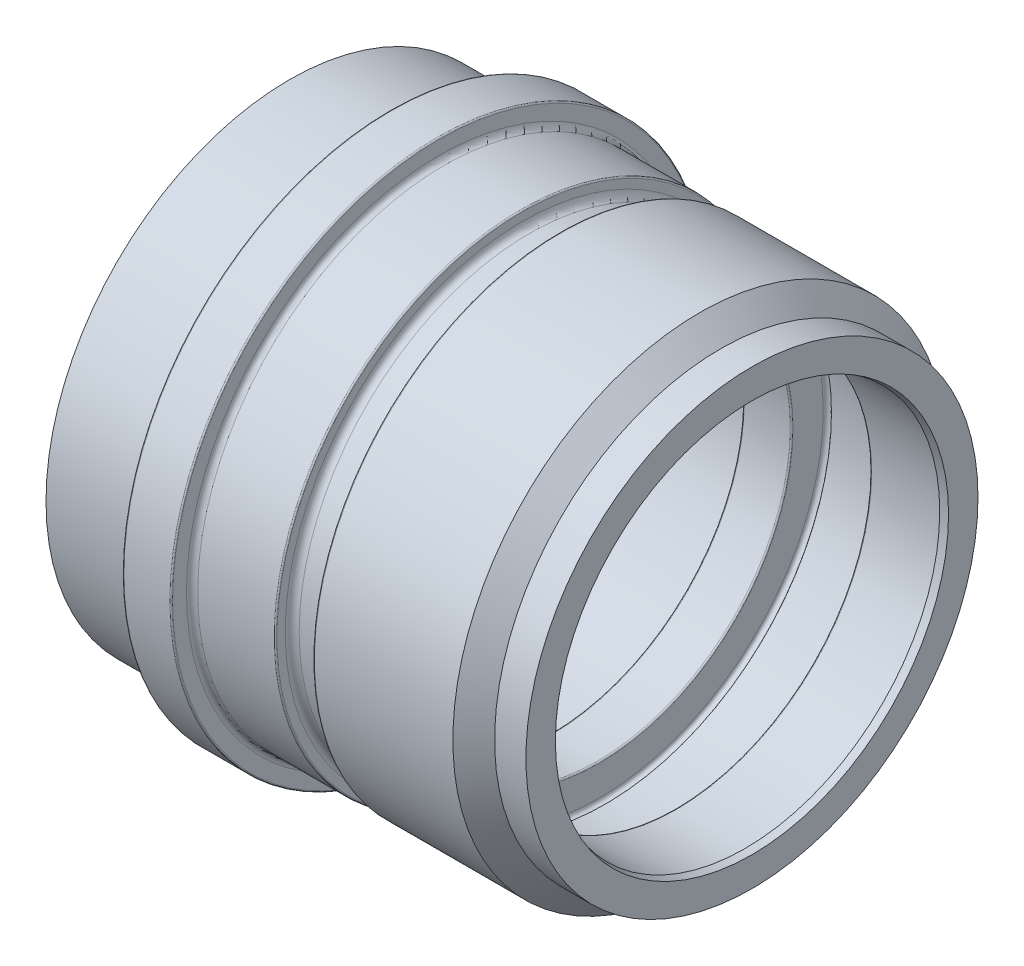
ISO-10303-21;
HEADER;
FILE_DESCRIPTION(('STEP AP214'),'2;1');
FILE_NAME('part.step','',(''),(''),'','','');
FILE_SCHEMA(('AUTOMOTIVE_DESIGN { 1 0 10303 214 1 1 1 1 }'));
ENDSEC;
DATA;
#1=APPLICATION_CONTEXT('core data for automotive mechanical design processes');
#2=APPLICATION_PROTOCOL_DEFINITION('international standard','automotive_design',2000,#1);
#3=PRODUCT_CONTEXT('',#1,'mechanical');
#4=PRODUCT('Part','Part','',(#3));
#5=PRODUCT_RELATED_PRODUCT_CATEGORY('part','',(#4));
#6=PRODUCT_DEFINITION_FORMATION('','',#4);
#7=PRODUCT_DEFINITION_CONTEXT('part definition',#1,'design');
#8=PRODUCT_DEFINITION('design','',#6,#7);
#9=PRODUCT_DEFINITION_SHAPE('','',#8);
#10=(LENGTH_UNIT() NAMED_UNIT(*) SI_UNIT(.MILLI.,.METRE.));
#11=(NAMED_UNIT(*) PLANE_ANGLE_UNIT() SI_UNIT($,.RADIAN.));
#12=(NAMED_UNIT(*) SI_UNIT($,.STERADIAN.) SOLID_ANGLE_UNIT());
#13=UNCERTAINTY_MEASURE_WITH_UNIT(LENGTH_MEASURE(1.E-05),#10,'distance_accuracy_value','');
#14=(GEOMETRIC_REPRESENTATION_CONTEXT(3) GLOBAL_UNCERTAINTY_ASSIGNED_CONTEXT((#13)) GLOBAL_UNIT_ASSIGNED_CONTEXT((#10,
#11,#12)) REPRESENTATION_CONTEXT('',''));
#15=CARTESIAN_POINT('',(0.,0.,0.));
#16=DIRECTION('',(0.,0.,1.));
#17=DIRECTION('',(1.,0.,0.));
#18=AXIS2_PLACEMENT_3D('',#15,#16,#17);
#19=CARTESIAN_POINT('',(-21.5,35.,0.));
#20=DIRECTION('',(-1.,0.,0.));
#21=DIRECTION('',(0.,0.,1.));
#22=AXIS2_PLACEMENT_3D('',#19,#20,#21);
#23=PLANE('',#22);
#24=CARTESIAN_POINT('',(-21.5,0.,0.));
#25=DIRECTION('',(1.,0.,0.));
#26=DIRECTION('',(0.,0.,-1.));
#27=AXIS2_PLACEMENT_3D('',#24,#25,#26);
#28=CIRCLE('',#27,33.0773502691896);
#29=CARTESIAN_POINT('',(-21.5,0.,-33.0773502691896));
#30=VERTEX_POINT('',#29);
#31=EDGE_CURVE('E170',#30,#30,#28,.T.);
#32=ORIENTED_EDGE('',*,*,#31,.T.);
#33=EDGE_LOOP('',(#32));
#34=FACE_BOUND('',#33,.T.);
#35=CARTESIAN_POINT('',(-21.5,0.,0.));
#36=DIRECTION('',(1.,0.,0.));
#37=DIRECTION('',(0.,0.,-1.));
#38=AXIS2_PLACEMENT_3D('',#35,#36,#37);
#39=CIRCLE('',#38,35.);
#40=CARTESIAN_POINT('',(-21.5,0.,-35.));
#41=VERTEX_POINT('',#40);
#42=EDGE_CURVE('E10',#41,#41,#39,.T.);
#43=ORIENTED_EDGE('',*,*,#42,.F.);
#44=EDGE_LOOP('',(#43));
#45=FACE_BOUND('',#44,.T.);
#46=ADVANCED_FACE('F37',(#34,#45),#23,.T.);
#47=CARTESIAN_POINT('',(0.,0.,0.));
#48=DIRECTION('',(1.,0.,0.));
#49=DIRECTION('',(0.,0.,-1.));
#50=AXIS2_PLACEMENT_3D('',#47,#48,#49);
#51=CYLINDRICAL_SURFACE('',#50,35.);
#52=ORIENTED_EDGE('',*,*,#42,.T.);
#53=EDGE_LOOP('',(#52));
#54=FACE_BOUND('',#53,.T.);
#55=CARTESIAN_POINT('',(-7.2,0.,0.));
#56=DIRECTION('',(1.,0.,0.));
#57=DIRECTION('',(0.,0.,-1.));
#58=AXIS2_PLACEMENT_3D('',#55,#56,#57);
#59=CIRCLE('',#58,35.);
#60=CARTESIAN_POINT('',(-7.2,0.,-35.));
#61=VERTEX_POINT('',#60);
#62=EDGE_CURVE('E43',#61,#61,#59,.T.);
#63=ORIENTED_EDGE('',*,*,#62,.F.);
#64=EDGE_LOOP('',(#63));
#65=FACE_BOUND('',#64,.T.);
#66=ADVANCED_FACE('F188',(#54,#65),#51,.T.);
#67=CARTESIAN_POINT('',(-7.2,0.,0.));
#68=DIRECTION('',(1.,0.,0.));
#69=DIRECTION('',(0.,0.,-1.));
#70=AXIS2_PLACEMENT_3D('',#67,#68,#69);
#71=TOROIDAL_SURFACE('',#70,35.2,0.2);
#72=ORIENTED_EDGE('',*,*,#62,.T.);
#73=EDGE_LOOP('',(#72));
#74=FACE_BOUND('',#73,.T.);
#75=CARTESIAN_POINT('',(-7.,0.,0.));
#76=DIRECTION('',(1.,0.,0.));
#77=DIRECTION('',(0.,0.,-1.));
#78=AXIS2_PLACEMENT_3D('',#75,#76,#77);
#79=CIRCLE('',#78,35.2);
#80=CARTESIAN_POINT('',(-7.,0.,-35.2));
#81=VERTEX_POINT('',#80);
#82=EDGE_CURVE('E47',#81,#81,#79,.T.);
#83=ORIENTED_EDGE('',*,*,#82,.F.);
#84=EDGE_LOOP('',(#83));
#85=FACE_BOUND('',#84,.T.);
#86=ADVANCED_FACE('F192',(#74,#85),#71,.F.);
#87=CARTESIAN_POINT('',(-7.,38.3,0.));
#88=DIRECTION('',(-1.,0.,0.));
#89=DIRECTION('',(0.,0.,1.));
#90=AXIS2_PLACEMENT_3D('',#87,#88,#89);
#91=PLANE('',#90);
#92=ORIENTED_EDGE('',*,*,#82,.T.);
#93=EDGE_LOOP('',(#92));
#94=FACE_BOUND('',#93,.T.);
#95=CARTESIAN_POINT('',(-7.,0.,0.));
#96=DIRECTION('',(1.,0.,0.));
#97=DIRECTION('',(0.,0.,-1.));
#98=AXIS2_PLACEMENT_3D('',#95,#96,#97);
#99=CIRCLE('',#98,38.3);
#100=CARTESIAN_POINT('',(-7.,0.,-38.3));
#101=VERTEX_POINT('',#100);
#102=EDGE_CURVE('E51',#101,#101,#99,.T.);
#103=ORIENTED_EDGE('',*,*,#102,.F.);
#104=EDGE_LOOP('',(#103));
#105=FACE_BOUND('',#104,.T.);
#106=ADVANCED_FACE('F196',(#94,#105),#91,.T.);
#107=CARTESIAN_POINT('',(-6.8,0.,0.));
#108=DIRECTION('',(1.,0.,0.));
#109=DIRECTION('',(0.,0.,-1.));
#110=AXIS2_PLACEMENT_3D('',#107,#108,#109);
#111=TOROIDAL_SURFACE('',#110,38.3,0.199999999999999);
#112=ORIENTED_EDGE('',*,*,#102,.T.);
#113=EDGE_LOOP('',(#112));
#114=FACE_BOUND('',#113,.T.);
#115=CARTESIAN_POINT('',(-6.8,0.,0.));
#116=DIRECTION('',(1.,0.,0.));
#117=DIRECTION('',(0.,0.,-1.));
#118=AXIS2_PLACEMENT_3D('',#115,#116,#117);
#119=CIRCLE('',#118,38.5);
#120=CARTESIAN_POINT('',(-6.8,0.,-38.5));
#121=VERTEX_POINT('',#120);
#122=EDGE_CURVE('E56',#121,#121,#119,.T.);
#123=ORIENTED_EDGE('',*,*,#122,.F.);
#124=EDGE_LOOP('',(#123));
#125=FACE_BOUND('',#124,.T.);
#126=ADVANCED_FACE('F202',(#114,#125),#111,.T.);
#127=CARTESIAN_POINT('',(0.,0.,0.));
#128=DIRECTION('',(1.,0.,0.));
#129=DIRECTION('',(0.,0.,-1.));
#130=AXIS2_PLACEMENT_3D('',#127,#128,#129);
#131=CYLINDRICAL_SURFACE('',#130,38.5);
#132=ORIENTED_EDGE('',*,*,#122,.T.);
#133=EDGE_LOOP('',(#132));
#134=FACE_BOUND('',#133,.T.);
#135=CARTESIAN_POINT('',(-0.200000000000001,0.,0.));
#136=DIRECTION('',(1.,0.,0.));
#137=DIRECTION('',(0.,0.,-1.));
#138=AXIS2_PLACEMENT_3D('',#135,#136,#137);
#139=CIRCLE('',#138,38.5);
#140=CARTESIAN_POINT('',(-0.200000000000001,0.,-38.5));
#141=VERTEX_POINT('',#140);
#142=EDGE_CURVE('E59',#141,#141,#139,.T.);
#143=ORIENTED_EDGE('',*,*,#142,.F.);
#144=EDGE_LOOP('',(#143));
#145=FACE_BOUND('',#144,.T.);
#146=ADVANCED_FACE('F206',(#134,#145),#131,.T.);
#147=CARTESIAN_POINT('',(-0.2,0.,0.));
#148=DIRECTION('',(1.,0.,0.));
#149=DIRECTION('',(0.,0.,-1.));
#150=AXIS2_PLACEMENT_3D('',#147,#148,#149);
#151=TOROIDAL_SURFACE('',#150,38.3,0.199999999999999);
#152=ORIENTED_EDGE('',*,*,#142,.T.);
#153=EDGE_LOOP('',(#152));
#154=FACE_BOUND('',#153,.T.);
#155=CARTESIAN_POINT('',(0.,0.,0.));
#156=DIRECTION('',(1.,0.,0.));
#157=DIRECTION('',(0.,0.,-1.));
#158=AXIS2_PLACEMENT_3D('',#155,#156,#157);
#159=CIRCLE('',#158,38.3);
#160=CARTESIAN_POINT('',(0.,0.,-38.3));
#161=VERTEX_POINT('',#160);
#162=EDGE_CURVE('E62',#161,#161,#159,.T.);
#163=ORIENTED_EDGE('',*,*,#162,.F.);
#164=EDGE_LOOP('',(#163));
#165=FACE_BOUND('',#164,.T.);
#166=ADVANCED_FACE('F210',(#154,#165),#151,.T.);
#167=CARTESIAN_POINT('',(0.,36.3,0.));
#168=DIRECTION('',(1.,0.,0.));
#169=DIRECTION('',(0.,0.,-1.));
#170=AXIS2_PLACEMENT_3D('',#167,#168,#169);
#171=PLANE('',#170);
#172=ORIENTED_EDGE('',*,*,#162,.T.);
#173=EDGE_LOOP('',(#172));
#174=FACE_BOUND('',#173,.T.);
#175=CARTESIAN_POINT('',(0.,0.,0.));
#176=DIRECTION('',(1.,0.,0.));
#177=DIRECTION('',(0.,0.,-1.));
#178=AXIS2_PLACEMENT_3D('',#175,#176,#177);
#179=CIRCLE('',#178,36.3);
#180=CARTESIAN_POINT('',(0.,0.,-36.3));
#181=VERTEX_POINT('',#180);
#182=EDGE_CURVE('E65',#181,#181,#179,.T.);
#183=ORIENTED_EDGE('',*,*,#182,.F.);
#184=EDGE_LOOP('',(#183));
#185=FACE_BOUND('',#184,.T.);
#186=ADVANCED_FACE('F214',(#174,#185),#171,.T.);
#187=CARTESIAN_POINT('',(0.8,0.,0.));
#188=DIRECTION('',(1.,0.,0.));
#189=DIRECTION('',(0.,0.,-1.));
#190=AXIS2_PLACEMENT_3D('',#187,#188,#189);
#191=TOROIDAL_SURFACE('',#190,36.3,0.799999999999998);
#192=CARTESIAN_POINT('',(0.8,0.,0.));
#193=DIRECTION('',(1.,0.,0.));
#194=DIRECTION('',(0.,0.,-1.));
#195=AXIS2_PLACEMENT_3D('',#192,#193,#194);
#196=CIRCLE('',#195,35.5);
#197=CARTESIAN_POINT('',(0.8,0.,-35.5));
#198=VERTEX_POINT('',#197);
#199=EDGE_CURVE('E68',#198,#198,#196,.T.);
#200=ORIENTED_EDGE('',*,*,#199,.F.);
#201=EDGE_LOOP('',(#200));
#202=FACE_BOUND('',#201,.T.);
#203=ORIENTED_EDGE('',*,*,#182,.T.);
#204=EDGE_LOOP('',(#203));
#205=FACE_BOUND('',#204,.T.);
#206=ADVANCED_FACE('F218',(#202,#205),#191,.F.);
#207=CARTESIAN_POINT('',(0.,0.,0.));
#208=DIRECTION('',(1.,0.,0.));
#209=DIRECTION('',(0.,0.,-1.));
#210=AXIS2_PLACEMENT_3D('',#207,#208,#209);
#211=CYLINDRICAL_SURFACE('',#210,35.5);
#212=ORIENTED_EDGE('',*,*,#199,.T.);
#213=EDGE_LOOP('',(#212));
#214=FACE_BOUND('',#213,.T.);
#215=CARTESIAN_POINT('',(11.8,0.,0.));
#216=DIRECTION('',(1.,0.,0.));
#217=DIRECTION('',(0.,0.,-1.));
#218=AXIS2_PLACEMENT_3D('',#215,#216,#217);
#219=CIRCLE('',#218,35.5);
#220=CARTESIAN_POINT('',(11.8,0.,-35.5));
#221=VERTEX_POINT('',#220);
#222=EDGE_CURVE('E71',#221,#221,#219,.T.);
#223=ORIENTED_EDGE('',*,*,#222,.F.);
#224=EDGE_LOOP('',(#223));
#225=FACE_BOUND('',#224,.T.);
#226=ADVANCED_FACE('F222',(#214,#225),#211,.T.);
#227=CARTESIAN_POINT('',(11.8,0.,0.));
#228=DIRECTION('',(1.,0.,0.));
#229=DIRECTION('',(0.,0.,-1.));
#230=AXIS2_PLACEMENT_3D('',#227,#228,#229);
#231=TOROIDAL_SURFACE('',#230,35.3,0.2);
#232=ORIENTED_EDGE('',*,*,#222,.T.);
#233=EDGE_LOOP('',(#232));
#234=FACE_BOUND('',#233,.T.);
#235=CARTESIAN_POINT('',(12.,0.,0.));
#236=DIRECTION('',(1.,0.,0.));
#237=DIRECTION('',(0.,0.,-1.));
#238=AXIS2_PLACEMENT_3D('',#235,#236,#237);
#239=CIRCLE('',#238,35.3);
#240=CARTESIAN_POINT('',(12.,0.,-35.3));
#241=VERTEX_POINT('',#240);
#242=EDGE_CURVE('E74',#241,#241,#239,.T.);
#243=ORIENTED_EDGE('',*,*,#242,.F.);
#244=EDGE_LOOP('',(#243));
#245=FACE_BOUND('',#244,.T.);
#246=ADVANCED_FACE('F226',(#234,#245),#231,.T.);
#247=CARTESIAN_POINT('',(12.,34.1,0.));
#248=DIRECTION('',(1.,0.,0.));
#249=DIRECTION('',(0.,0.,-1.));
#250=AXIS2_PLACEMENT_3D('',#247,#248,#249);
#251=PLANE('',#250);
#252=ORIENTED_EDGE('',*,*,#242,.T.);
#253=EDGE_LOOP('',(#252));
#254=FACE_BOUND('',#253,.T.);
#255=CARTESIAN_POINT('',(12.,0.,0.));
#256=DIRECTION('',(1.,0.,0.));
#257=DIRECTION('',(0.,0.,-1.));
#258=AXIS2_PLACEMENT_3D('',#255,#256,#257);
#259=CIRCLE('',#258,34.1);
#260=CARTESIAN_POINT('',(12.,0.,-34.1));
#261=VERTEX_POINT('',#260);
#262=EDGE_CURVE('E77',#261,#261,#259,.T.);
#263=ORIENTED_EDGE('',*,*,#262,.F.);
#264=EDGE_LOOP('',(#263));
#265=FACE_BOUND('',#264,.T.);
#266=ADVANCED_FACE('F230',(#254,#265),#251,.T.);
#267=CARTESIAN_POINT('',(13.,0.,0.));
#268=DIRECTION('',(1.,0.,0.));
#269=DIRECTION('',(0.,0.,-1.));
#270=AXIS2_PLACEMENT_3D('',#267,#268,#269);
#271=TOROIDAL_SURFACE('',#270,34.1,1.);
#272=ORIENTED_EDGE('',*,*,#262,.T.);
#273=EDGE_LOOP('',(#272));
#274=FACE_BOUND('',#273,.T.);
#275=CARTESIAN_POINT('',(13.,0.,0.));
#276=DIRECTION('',(1.,0.,0.));
#277=DIRECTION('',(0.,0.,-1.));
#278=AXIS2_PLACEMENT_3D('',#275,#276,#277);
#279=CIRCLE('',#278,33.1);
#280=CARTESIAN_POINT('',(13.,0.,-33.1));
#281=VERTEX_POINT('',#280);
#282=EDGE_CURVE('E80',#281,#281,#279,.T.);
#283=ORIENTED_EDGE('',*,*,#282,.F.);
#284=EDGE_LOOP('',(#283));
#285=FACE_BOUND('',#284,.T.);
#286=ADVANCED_FACE('F234',(#274,#285),#271,.F.);
#287=CARTESIAN_POINT('',(0.,0.,0.));
#288=DIRECTION('',(1.,0.,0.));
#289=DIRECTION('',(0.,0.,-1.));
#290=AXIS2_PLACEMENT_3D('',#287,#288,#289);
#291=CYLINDRICAL_SURFACE('',#290,33.1);
#292=ORIENTED_EDGE('',*,*,#282,.T.);
#293=EDGE_LOOP('',(#292));
#294=FACE_BOUND('',#293,.T.);
#295=CARTESIAN_POINT('',(16.4,0.,0.));
#296=DIRECTION('',(1.,0.,0.));
#297=DIRECTION('',(0.,0.,-1.));
#298=AXIS2_PLACEMENT_3D('',#295,#296,#297);
#299=CIRCLE('',#298,33.1);
#300=CARTESIAN_POINT('',(16.4,0.,-33.1));
#301=VERTEX_POINT('',#300);
#302=EDGE_CURVE('E83',#301,#301,#299,.T.);
#303=ORIENTED_EDGE('',*,*,#302,.F.);
#304=EDGE_LOOP('',(#303));
#305=FACE_BOUND('',#304,.T.);
#306=ADVANCED_FACE('F238',(#294,#305),#291,.T.);
#307=CARTESIAN_POINT('',(16.4,0.,0.));
#308=DIRECTION('',(1.,0.,0.));
#309=DIRECTION('',(0.,0.,-1.));
#310=AXIS2_PLACEMENT_3D('',#307,#308,#309);
#311=TOROIDAL_SURFACE('',#310,34.1,1.);
#312=ORIENTED_EDGE('',*,*,#302,.T.);
#313=EDGE_LOOP('',(#312));
#314=FACE_BOUND('',#313,.T.);
#315=CARTESIAN_POINT('',(17.4,0.,0.));
#316=DIRECTION('',(1.,0.,0.));
#317=DIRECTION('',(0.,0.,-1.));
#318=AXIS2_PLACEMENT_3D('',#315,#316,#317);
#319=CIRCLE('',#318,34.1);
#320=CARTESIAN_POINT('',(17.4,0.,-34.1));
#321=VERTEX_POINT('',#320);
#322=EDGE_CURVE('E86',#321,#321,#319,.T.);
#323=ORIENTED_EDGE('',*,*,#322,.F.);
#324=EDGE_LOOP('',(#323));
#325=FACE_BOUND('',#324,.T.);
#326=ADVANCED_FACE('F242',(#314,#325),#311,.F.);
#327=CARTESIAN_POINT('',(17.4,35.3,0.));
#328=DIRECTION('',(-1.,0.,0.));
#329=DIRECTION('',(0.,0.,1.));
#330=AXIS2_PLACEMENT_3D('',#327,#328,#329);
#331=PLANE('',#330);
#332=ORIENTED_EDGE('',*,*,#322,.T.);
#333=EDGE_LOOP('',(#332));
#334=FACE_BOUND('',#333,.T.);
#335=CARTESIAN_POINT('',(17.4,0.,0.));
#336=DIRECTION('',(1.,0.,0.));
#337=DIRECTION('',(0.,0.,-1.));
#338=AXIS2_PLACEMENT_3D('',#335,#336,#337);
#339=CIRCLE('',#338,35.3);
#340=CARTESIAN_POINT('',(17.4,0.,-35.3));
#341=VERTEX_POINT('',#340);
#342=EDGE_CURVE('E89',#341,#341,#339,.T.);
#343=ORIENTED_EDGE('',*,*,#342,.F.);
#344=EDGE_LOOP('',(#343));
#345=FACE_BOUND('',#344,.T.);
#346=ADVANCED_FACE('F246',(#334,#345),#331,.T.);
#347=CARTESIAN_POINT('',(17.6,0.,0.));
#348=DIRECTION('',(1.,0.,0.));
#349=DIRECTION('',(0.,0.,-1.));
#350=AXIS2_PLACEMENT_3D('',#347,#348,#349);
#351=TOROIDAL_SURFACE('',#350,35.3,0.199999999999999);
#352=ORIENTED_EDGE('',*,*,#342,.T.);
#353=EDGE_LOOP('',(#352));
#354=FACE_BOUND('',#353,.T.);
#355=CARTESIAN_POINT('',(17.6,0.,0.));
#356=DIRECTION('',(1.,0.,0.));
#357=DIRECTION('',(0.,0.,-1.));
#358=AXIS2_PLACEMENT_3D('',#355,#356,#357);
#359=CIRCLE('',#358,35.5);
#360=CARTESIAN_POINT('',(17.6,0.,-35.5));
#361=VERTEX_POINT('',#360);
#362=EDGE_CURVE('E92',#361,#361,#359,.T.);
#363=ORIENTED_EDGE('',*,*,#362,.F.);
#364=EDGE_LOOP('',(#363));
#365=FACE_BOUND('',#364,.T.);
#366=ADVANCED_FACE('F250',(#354,#365),#351,.T.);
#367=CARTESIAN_POINT('',(0.,0.,0.));
#368=DIRECTION('',(1.,0.,0.));
#369=DIRECTION('',(0.,0.,-1.));
#370=AXIS2_PLACEMENT_3D('',#367,#368,#369);
#371=CYLINDRICAL_SURFACE('',#370,35.5);
#372=ORIENTED_EDGE('',*,*,#362,.T.);
#373=EDGE_LOOP('',(#372));
#374=FACE_BOUND('',#373,.T.);
#375=CARTESIAN_POINT('',(37.5,0.,0.));
#376=DIRECTION('',(1.,0.,0.));
#377=DIRECTION('',(0.,0.,-1.));
#378=AXIS2_PLACEMENT_3D('',#375,#376,#377);
#379=CIRCLE('',#378,35.5);
#380=CARTESIAN_POINT('',(37.5,0.,-35.5));
#381=VERTEX_POINT('',#380);
#382=EDGE_CURVE('E95',#381,#381,#379,.T.);
#383=ORIENTED_EDGE('',*,*,#382,.F.);
#384=EDGE_LOOP('',(#383));
#385=FACE_BOUND('',#384,.T.);
#386=ADVANCED_FACE('F254',(#374,#385),#371,.T.);
#387=CARTESIAN_POINT('',(40.5,0.,0.));
#388=DIRECTION('',(-1.,0.,0.));
#389=DIRECTION('',(0.,0.,1.));
#390=AXIS2_PLACEMENT_3D('',#387,#388,#389);
#391=CONICAL_SURFACE('',#390,32.5,0.78539816339745);
#392=ORIENTED_EDGE('',*,*,#382,.T.);
#393=EDGE_LOOP('',(#392));
#394=FACE_BOUND('',#393,.T.);
#395=CARTESIAN_POINT('',(40.5,0.,0.));
#396=DIRECTION('',(1.,0.,0.));
#397=DIRECTION('',(0.,0.,-1.));
#398=AXIS2_PLACEMENT_3D('',#395,#396,#397);
#399=CIRCLE('',#398,32.5);
#400=CARTESIAN_POINT('',(40.5,0.,-32.5));
#401=VERTEX_POINT('',#400);
#402=EDGE_CURVE('E98',#401,#401,#399,.T.);
#403=ORIENTED_EDGE('',*,*,#402,.F.);
#404=EDGE_LOOP('',(#403));
#405=FACE_BOUND('',#404,.T.);
#406=ADVANCED_FACE('F258',(#394,#405),#391,.T.);
#407=CARTESIAN_POINT('',(0.,0.,0.));
#408=DIRECTION('',(1.,0.,0.));
#409=DIRECTION('',(0.,0.,-1.));
#410=AXIS2_PLACEMENT_3D('',#407,#408,#409);
#411=CYLINDRICAL_SURFACE('',#410,32.5);
#412=ORIENTED_EDGE('',*,*,#402,.T.);
#413=EDGE_LOOP('',(#412));
#414=FACE_BOUND('',#413,.T.);
#415=CARTESIAN_POINT('',(45.,0.,0.));
#416=DIRECTION('',(1.,0.,0.));
#417=DIRECTION('',(0.,0.,-1.));
#418=AXIS2_PLACEMENT_3D('',#415,#416,#417);
#419=CIRCLE('',#418,32.5);
#420=CARTESIAN_POINT('',(45.,0.,-32.5));
#421=VERTEX_POINT('',#420);
#422=EDGE_CURVE('E101',#421,#421,#419,.T.);
#423=ORIENTED_EDGE('',*,*,#422,.F.);
#424=EDGE_LOOP('',(#423));
#425=FACE_BOUND('',#424,.T.);
#426=ADVANCED_FACE('F262',(#414,#425),#411,.T.);
#427=CARTESIAN_POINT('',(45.,28.2679491924311,0.));
#428=DIRECTION('',(1.,0.,0.));
#429=DIRECTION('',(0.,0.,-1.));
#430=AXIS2_PLACEMENT_3D('',#427,#428,#429);
#431=PLANE('',#430);
#432=ORIENTED_EDGE('',*,*,#422,.T.);
#433=EDGE_LOOP('',(#432));
#434=FACE_BOUND('',#433,.T.);
#435=CARTESIAN_POINT('',(45.,0.,0.));
#436=DIRECTION('',(1.,0.,0.));
#437=DIRECTION('',(0.,0.,-1.));
#438=AXIS2_PLACEMENT_3D('',#435,#436,#437);
#439=CIRCLE('',#438,28.2679491924311);
#440=CARTESIAN_POINT('',(45.,0.,-28.2679491924311));
#441=VERTEX_POINT('',#440);
#442=EDGE_CURVE('E104',#441,#441,#439,.T.);
#443=ORIENTED_EDGE('',*,*,#442,.F.);
#444=EDGE_LOOP('',(#443));
#445=FACE_BOUND('',#444,.T.);
#446=ADVANCED_FACE('F266',(#434,#445),#431,.T.);
#447=CARTESIAN_POINT('',(44.,0.,0.));
#448=DIRECTION('',(1.,0.,0.));
#449=DIRECTION('',(0.,0.,-1.));
#450=AXIS2_PLACEMENT_3D('',#447,#448,#449);
#451=CONICAL_SURFACE('',#450,28.,0.26179938779915);
#452=ORIENTED_EDGE('',*,*,#442,.T.);
#453=EDGE_LOOP('',(#452));
#454=FACE_BOUND('',#453,.T.);
#455=CARTESIAN_POINT('',(44.,0.,0.));
#456=DIRECTION('',(1.,0.,0.));
#457=DIRECTION('',(0.,0.,-1.));
#458=AXIS2_PLACEMENT_3D('',#455,#456,#457);
#459=CIRCLE('',#458,28.);
#460=CARTESIAN_POINT('',(44.,0.,-28.));
#461=VERTEX_POINT('',#460);
#462=EDGE_CURVE('E107',#461,#461,#459,.T.);
#463=ORIENTED_EDGE('',*,*,#462,.F.);
#464=EDGE_LOOP('',(#463));
#465=FACE_BOUND('',#464,.T.);
#466=ADVANCED_FACE('F270',(#454,#465),#451,.F.);
#467=CARTESIAN_POINT('',(0.,0.,0.));
#468=DIRECTION('',(1.,0.,0.));
#469=DIRECTION('',(0.,0.,-1.));
#470=AXIS2_PLACEMENT_3D('',#467,#468,#469);
#471=CYLINDRICAL_SURFACE('',#470,28.);
#472=ORIENTED_EDGE('',*,*,#462,.T.);
#473=EDGE_LOOP('',(#472));
#474=FACE_BOUND('',#473,.T.);
#475=CARTESIAN_POINT('',(34.2,0.,0.));
#476=DIRECTION('',(1.,0.,0.));
#477=DIRECTION('',(0.,0.,-1.));
#478=AXIS2_PLACEMENT_3D('',#475,#476,#477);
#479=CIRCLE('',#478,28.);
#480=CARTESIAN_POINT('',(34.2,0.,-28.));
#481=VERTEX_POINT('',#480);
#482=EDGE_CURVE('E110',#481,#481,#479,.T.);
#483=ORIENTED_EDGE('',*,*,#482,.F.);
#484=EDGE_LOOP('',(#483));
#485=FACE_BOUND('',#484,.T.);
#486=ADVANCED_FACE('F274',(#474,#485),#471,.F.);
#487=CARTESIAN_POINT('',(34.2,0.,0.));
#488=DIRECTION('',(1.,0.,0.));
#489=DIRECTION('',(0.,0.,-1.));
#490=AXIS2_PLACEMENT_3D('',#487,#488,#489);
#491=TOROIDAL_SURFACE('',#490,28.2,0.199999999999999);
#492=ORIENTED_EDGE('',*,*,#482,.T.);
#493=EDGE_LOOP('',(#492));
#494=FACE_BOUND('',#493,.T.);
#495=CARTESIAN_POINT('',(34.,0.,0.));
#496=DIRECTION('',(1.,0.,0.));
#497=DIRECTION('',(0.,0.,-1.));
#498=AXIS2_PLACEMENT_3D('',#495,#496,#497);
#499=CIRCLE('',#498,28.2);
#500=CARTESIAN_POINT('',(34.,0.,-28.2));
#501=VERTEX_POINT('',#500);
#502=EDGE_CURVE('E113',#501,#501,#499,.T.);
#503=ORIENTED_EDGE('',*,*,#502,.F.);
#504=EDGE_LOOP('',(#503));
#505=FACE_BOUND('',#504,.T.);
#506=ADVANCED_FACE('F278',(#494,#505),#491,.T.);
#507=CARTESIAN_POINT('',(34.,32.1,0.));
#508=DIRECTION('',(-1.,0.,0.));
#509=DIRECTION('',(0.,0.,1.));
#510=AXIS2_PLACEMENT_3D('',#507,#508,#509);
#511=PLANE('',#510);
#512=ORIENTED_EDGE('',*,*,#502,.T.);
#513=EDGE_LOOP('',(#512));
#514=FACE_BOUND('',#513,.T.);
#515=CARTESIAN_POINT('',(34.,0.,0.));
#516=DIRECTION('',(1.,0.,0.));
#517=DIRECTION('',(0.,0.,-1.));
#518=AXIS2_PLACEMENT_3D('',#515,#516,#517);
#519=CIRCLE('',#518,32.1);
#520=CARTESIAN_POINT('',(34.,0.,-32.1));
#521=VERTEX_POINT('',#520);
#522=EDGE_CURVE('E116',#521,#521,#519,.T.);
#523=ORIENTED_EDGE('',*,*,#522,.F.);
#524=EDGE_LOOP('',(#523));
#525=FACE_BOUND('',#524,.T.);
#526=ADVANCED_FACE('F282',(#514,#525),#511,.T.);
#527=CARTESIAN_POINT('',(33.6,0.,0.));
#528=DIRECTION('',(1.,0.,0.));
#529=DIRECTION('',(0.,0.,-1.));
#530=AXIS2_PLACEMENT_3D('',#527,#528,#529);
#531=TOROIDAL_SURFACE('',#530,32.1,0.399999999999998);
#532=ORIENTED_EDGE('',*,*,#522,.T.);
#533=EDGE_LOOP('',(#532));
#534=FACE_BOUND('',#533,.T.);
#535=CARTESIAN_POINT('',(33.6,0.,0.));
#536=DIRECTION('',(1.,0.,0.));
#537=DIRECTION('',(0.,0.,-1.));
#538=AXIS2_PLACEMENT_3D('',#535,#536,#537);
#539=CIRCLE('',#538,32.5);
#540=CARTESIAN_POINT('',(33.6,0.,-32.5));
#541=VERTEX_POINT('',#540);
#542=EDGE_CURVE('E119',#541,#541,#539,.T.);
#543=ORIENTED_EDGE('',*,*,#542,.F.);
#544=EDGE_LOOP('',(#543));
#545=FACE_BOUND('',#544,.T.);
#546=ADVANCED_FACE('F286',(#534,#545),#531,.F.);
#547=CARTESIAN_POINT('',(0.,0.,0.));
#548=DIRECTION('',(1.,0.,0.));
#549=DIRECTION('',(0.,0.,-1.));
#550=AXIS2_PLACEMENT_3D('',#547,#548,#549);
#551=CYLINDRICAL_SURFACE('',#550,32.5);
#552=ORIENTED_EDGE('',*,*,#542,.T.);
#553=EDGE_LOOP('',(#552));
#554=FACE_BOUND('',#553,.T.);
#555=CARTESIAN_POINT('',(23.9330127018922,0.,0.));
#556=DIRECTION('',(1.,0.,0.));
#557=DIRECTION('',(0.,0.,-1.));
#558=AXIS2_PLACEMENT_3D('',#555,#556,#557);
#559=CIRCLE('',#558,32.5);
#560=CARTESIAN_POINT('',(23.9330127018922,0.,-32.5));
#561=VERTEX_POINT('',#560);
#562=EDGE_CURVE('E122',#561,#561,#559,.T.);
#563=ORIENTED_EDGE('',*,*,#562,.F.);
#564=EDGE_LOOP('',(#563));
#565=FACE_BOUND('',#564,.T.);
#566=ADVANCED_FACE('F290',(#554,#565),#551,.F.);
#567=CARTESIAN_POINT('',(23.5,0.,0.));
#568=DIRECTION('',(1.,0.,0.));
#569=DIRECTION('',(0.,0.,-1.));
#570=AXIS2_PLACEMENT_3D('',#567,#568,#569);
#571=TOROIDAL_SURFACE('',#570,32.25,0.500000000000001);
#572=ORIENTED_EDGE('',*,*,#562,.T.);
#573=EDGE_LOOP('',(#572));
#574=FACE_BOUND('',#573,.T.);
#575=CARTESIAN_POINT('',(23.,0.,0.));
#576=DIRECTION('',(1.,0.,0.));
#577=DIRECTION('',(0.,0.,-1.));
#578=AXIS2_PLACEMENT_3D('',#575,#576,#577);
#579=CIRCLE('',#578,32.25);
#580=CARTESIAN_POINT('',(23.,0.,-32.25));
#581=VERTEX_POINT('',#580);
#582=EDGE_CURVE('E125',#581,#581,#579,.T.);
#583=ORIENTED_EDGE('',*,*,#582,.F.);
#584=EDGE_LOOP('',(#583));
#585=FACE_BOUND('',#584,.T.);
#586=ADVANCED_FACE('F294',(#574,#585),#571,.F.);
#587=CARTESIAN_POINT('',(23.,27.9,0.));
#588=DIRECTION('',(1.,0.,0.));
#589=DIRECTION('',(0.,0.,-1.));
#590=AXIS2_PLACEMENT_3D('',#587,#588,#589);
#591=PLANE('',#590);
#592=ORIENTED_EDGE('',*,*,#582,.T.);
#593=EDGE_LOOP('',(#592));
#594=FACE_BOUND('',#593,.T.);
#595=CARTESIAN_POINT('',(23.,0.,0.));
#596=DIRECTION('',(1.,0.,0.));
#597=DIRECTION('',(0.,0.,-1.));
#598=AXIS2_PLACEMENT_3D('',#595,#596,#597);
#599=CIRCLE('',#598,27.9);
#600=CARTESIAN_POINT('',(23.,0.,-27.9));
#601=VERTEX_POINT('',#600);
#602=EDGE_CURVE('E128',#601,#601,#599,.T.);
#603=ORIENTED_EDGE('',*,*,#602,.F.);
#604=EDGE_LOOP('',(#603));
#605=FACE_BOUND('',#604,.T.);
#606=ADVANCED_FACE('F298',(#594,#605),#591,.T.);
#607=CARTESIAN_POINT('',(22.8,0.,0.));
#608=DIRECTION('',(1.,0.,0.));
#609=DIRECTION('',(0.,0.,-1.));
#610=AXIS2_PLACEMENT_3D('',#607,#608,#609);
#611=TOROIDAL_SURFACE('',#610,27.9,0.199999999999999);
#612=ORIENTED_EDGE('',*,*,#602,.T.);
#613=EDGE_LOOP('',(#612));
#614=FACE_BOUND('',#613,.T.);
#615=CARTESIAN_POINT('',(22.8,0.,0.));
#616=DIRECTION('',(1.,0.,0.));
#617=DIRECTION('',(0.,0.,-1.));
#618=AXIS2_PLACEMENT_3D('',#615,#616,#617);
#619=CIRCLE('',#618,27.7);
#620=CARTESIAN_POINT('',(22.8,0.,-27.7));
#621=VERTEX_POINT('',#620);
#622=EDGE_CURVE('E131',#621,#621,#619,.T.);
#623=ORIENTED_EDGE('',*,*,#622,.F.);
#624=EDGE_LOOP('',(#623));
#625=FACE_BOUND('',#624,.T.);
#626=ADVANCED_FACE('F302',(#614,#625),#611,.T.);
#627=CARTESIAN_POINT('',(0.,0.,0.));
#628=DIRECTION('',(1.,0.,0.));
#629=DIRECTION('',(0.,0.,-1.));
#630=AXIS2_PLACEMENT_3D('',#627,#628,#629);
#631=CYLINDRICAL_SURFACE('',#630,27.7);
#632=ORIENTED_EDGE('',*,*,#622,.T.);
#633=EDGE_LOOP('',(#632));
#634=FACE_BOUND('',#633,.T.);
#635=CARTESIAN_POINT('',(16.2,0.,0.));
#636=DIRECTION('',(1.,0.,0.));
#637=DIRECTION('',(0.,0.,-1.));
#638=AXIS2_PLACEMENT_3D('',#635,#636,#637);
#639=CIRCLE('',#638,27.7);
#640=CARTESIAN_POINT('',(16.2,0.,-27.7));
#641=VERTEX_POINT('',#640);
#642=EDGE_CURVE('E134',#641,#641,#639,.T.);
#643=ORIENTED_EDGE('',*,*,#642,.F.);
#644=EDGE_LOOP('',(#643));
#645=FACE_BOUND('',#644,.T.);
#646=ADVANCED_FACE('F306',(#634,#645),#631,.F.);
#647=CARTESIAN_POINT('',(16.2,0.,0.));
#648=DIRECTION('',(1.,0.,0.));
#649=DIRECTION('',(0.,0.,-1.));
#650=AXIS2_PLACEMENT_3D('',#647,#648,#649);
#651=TOROIDAL_SURFACE('',#650,27.9,0.199999999999999);
#652=ORIENTED_EDGE('',*,*,#642,.T.);
#653=EDGE_LOOP('',(#652));
#654=FACE_BOUND('',#653,.T.);
#655=CARTESIAN_POINT('',(16.,0.,0.));
#656=DIRECTION('',(1.,0.,0.));
#657=DIRECTION('',(0.,0.,-1.));
#658=AXIS2_PLACEMENT_3D('',#655,#656,#657);
#659=CIRCLE('',#658,27.9);
#660=CARTESIAN_POINT('',(16.,0.,-27.9));
#661=VERTEX_POINT('',#660);
#662=EDGE_CURVE('E137',#661,#661,#659,.T.);
#663=ORIENTED_EDGE('',*,*,#662,.F.);
#664=EDGE_LOOP('',(#663));
#665=FACE_BOUND('',#664,.T.);
#666=ADVANCED_FACE('F310',(#654,#665),#651,.T.);
#667=CARTESIAN_POINT('',(16.,29.8,0.));
#668=DIRECTION('',(-1.,0.,0.));
#669=DIRECTION('',(0.,0.,1.));
#670=AXIS2_PLACEMENT_3D('',#667,#668,#669);
#671=PLANE('',#670);
#672=ORIENTED_EDGE('',*,*,#662,.T.);
#673=EDGE_LOOP('',(#672));
#674=FACE_BOUND('',#673,.T.);
#675=CARTESIAN_POINT('',(16.,0.,0.));
#676=DIRECTION('',(1.,0.,0.));
#677=DIRECTION('',(0.,0.,-1.));
#678=AXIS2_PLACEMENT_3D('',#675,#676,#677);
#679=CIRCLE('',#678,29.8);
#680=CARTESIAN_POINT('',(16.,0.,-29.8));
#681=VERTEX_POINT('',#680);
#682=EDGE_CURVE('E140',#681,#681,#679,.T.);
#683=ORIENTED_EDGE('',*,*,#682,.F.);
#684=EDGE_LOOP('',(#683));
#685=FACE_BOUND('',#684,.T.);
#686=ADVANCED_FACE('F314',(#674,#685),#671,.T.);
#687=CARTESIAN_POINT('',(15.8,0.,0.));
#688=DIRECTION('',(1.,0.,0.));
#689=DIRECTION('',(0.,0.,-1.));
#690=AXIS2_PLACEMENT_3D('',#687,#688,#689);
#691=TOROIDAL_SURFACE('',#690,29.8,0.199999999999999);
#692=ORIENTED_EDGE('',*,*,#682,.T.);
#693=EDGE_LOOP('',(#692));
#694=FACE_BOUND('',#693,.T.);
#695=CARTESIAN_POINT('',(15.8,0.,0.));
#696=DIRECTION('',(1.,0.,0.));
#697=DIRECTION('',(0.,0.,-1.));
#698=AXIS2_PLACEMENT_3D('',#695,#696,#697);
#699=CIRCLE('',#698,30.);
#700=CARTESIAN_POINT('',(15.8,0.,-30.));
#701=VERTEX_POINT('',#700);
#702=EDGE_CURVE('E143',#701,#701,#699,.T.);
#703=ORIENTED_EDGE('',*,*,#702,.F.);
#704=EDGE_LOOP('',(#703));
#705=FACE_BOUND('',#704,.T.);
#706=ADVANCED_FACE('F318',(#694,#705),#691,.F.);
#707=CARTESIAN_POINT('',(0.,0.,0.));
#708=DIRECTION('',(1.,0.,0.));
#709=DIRECTION('',(0.,0.,-1.));
#710=AXIS2_PLACEMENT_3D('',#707,#708,#709);
#711=CYLINDRICAL_SURFACE('',#710,30.);
#712=ORIENTED_EDGE('',*,*,#702,.T.);
#713=EDGE_LOOP('',(#712));
#714=FACE_BOUND('',#713,.T.);
#715=CARTESIAN_POINT('',(-8.8,0.,0.));
#716=DIRECTION('',(1.,0.,0.));
#717=DIRECTION('',(0.,0.,-1.));
#718=AXIS2_PLACEMENT_3D('',#715,#716,#717);
#719=CIRCLE('',#718,30.);
#720=CARTESIAN_POINT('',(-8.8,0.,-30.));
#721=VERTEX_POINT('',#720);
#722=EDGE_CURVE('E146',#721,#721,#719,.T.);
#723=ORIENTED_EDGE('',*,*,#722,.F.);
#724=EDGE_LOOP('',(#723));
#725=FACE_BOUND('',#724,.T.);
#726=ADVANCED_FACE('F322',(#714,#725),#711,.F.);
#727=CARTESIAN_POINT('',(-8.8,0.,0.));
#728=DIRECTION('',(1.,0.,0.));
#729=DIRECTION('',(0.,0.,-1.));
#730=AXIS2_PLACEMENT_3D('',#727,#728,#729);
#731=TOROIDAL_SURFACE('',#730,29.8,0.2);
#732=ORIENTED_EDGE('',*,*,#722,.T.);
#733=EDGE_LOOP('',(#732));
#734=FACE_BOUND('',#733,.T.);
#735=CARTESIAN_POINT('',(-9.,0.,0.));
#736=DIRECTION('',(1.,0.,0.));
#737=DIRECTION('',(0.,0.,-1.));
#738=AXIS2_PLACEMENT_3D('',#735,#736,#737);
#739=CIRCLE('',#738,29.8);
#740=CARTESIAN_POINT('',(-9.,0.,-29.8));
#741=VERTEX_POINT('',#740);
#742=EDGE_CURVE('E149',#741,#741,#739,.T.);
#743=ORIENTED_EDGE('',*,*,#742,.F.);
#744=EDGE_LOOP('',(#743));
#745=FACE_BOUND('',#744,.T.);
#746=ADVANCED_FACE('F326',(#734,#745),#731,.F.);
#747=CARTESIAN_POINT('',(-9.,28.2,0.));
#748=DIRECTION('',(1.,0.,0.));
#749=DIRECTION('',(0.,0.,-1.));
#750=AXIS2_PLACEMENT_3D('',#747,#748,#749);
#751=PLANE('',#750);
#752=ORIENTED_EDGE('',*,*,#742,.T.);
#753=EDGE_LOOP('',(#752));
#754=FACE_BOUND('',#753,.T.);
#755=CARTESIAN_POINT('',(-9.,0.,0.));
#756=DIRECTION('',(1.,0.,0.));
#757=DIRECTION('',(0.,0.,-1.));
#758=AXIS2_PLACEMENT_3D('',#755,#756,#757);
#759=CIRCLE('',#758,28.2);
#760=CARTESIAN_POINT('',(-9.,0.,-28.2));
#761=VERTEX_POINT('',#760);
#762=EDGE_CURVE('E152',#761,#761,#759,.T.);
#763=ORIENTED_EDGE('',*,*,#762,.F.);
#764=EDGE_LOOP('',(#763));
#765=FACE_BOUND('',#764,.T.);
#766=ADVANCED_FACE('F330',(#754,#765),#751,.T.);
#767=CARTESIAN_POINT('',(-9.2,0.,0.));
#768=DIRECTION('',(1.,0.,0.));
#769=DIRECTION('',(0.,0.,-1.));
#770=AXIS2_PLACEMENT_3D('',#767,#768,#769);
#771=TOROIDAL_SURFACE('',#770,28.2,0.199999999999998);
#772=ORIENTED_EDGE('',*,*,#762,.T.);
#773=EDGE_LOOP('',(#772));
#774=FACE_BOUND('',#773,.T.);
#775=CARTESIAN_POINT('',(-9.2,0.,0.));
#776=DIRECTION('',(1.,0.,0.));
#777=DIRECTION('',(0.,0.,-1.));
#778=AXIS2_PLACEMENT_3D('',#775,#776,#777);
#779=CIRCLE('',#778,28.);
#780=CARTESIAN_POINT('',(-9.2,0.,-28.));
#781=VERTEX_POINT('',#780);
#782=EDGE_CURVE('E155',#781,#781,#779,.T.);
#783=ORIENTED_EDGE('',*,*,#782,.F.);
#784=EDGE_LOOP('',(#783));
#785=FACE_BOUND('',#784,.T.);
#786=ADVANCED_FACE('F334',(#774,#785),#771,.T.);
#787=CARTESIAN_POINT('',(0.,0.,0.));
#788=DIRECTION('',(1.,0.,0.));
#789=DIRECTION('',(0.,0.,-1.));
#790=AXIS2_PLACEMENT_3D('',#787,#788,#789);
#791=CYLINDRICAL_SURFACE('',#790,28.);
#792=ORIENTED_EDGE('',*,*,#782,.T.);
#793=EDGE_LOOP('',(#792));
#794=FACE_BOUND('',#793,.T.);
#795=CARTESIAN_POINT('',(-14.,0.,0.));
#796=DIRECTION('',(1.,0.,0.));
#797=DIRECTION('',(0.,0.,-1.));
#798=AXIS2_PLACEMENT_3D('',#795,#796,#797);
#799=CIRCLE('',#798,28.);
#800=CARTESIAN_POINT('',(-14.,0.,-28.));
#801=VERTEX_POINT('',#800);
#802=EDGE_CURVE('E158',#801,#801,#799,.T.);
#803=ORIENTED_EDGE('',*,*,#802,.F.);
#804=EDGE_LOOP('',(#803));
#805=FACE_BOUND('',#804,.T.);
#806=ADVANCED_FACE('F338',(#794,#805),#791,.F.);
#807=CARTESIAN_POINT('',(-14.,31.7,0.));
#808=DIRECTION('',(-1.,0.,0.));
#809=DIRECTION('',(0.,0.,1.));
#810=AXIS2_PLACEMENT_3D('',#807,#808,#809);
#811=PLANE('',#810);
#812=ORIENTED_EDGE('',*,*,#802,.T.);
#813=EDGE_LOOP('',(#812));
#814=FACE_BOUND('',#813,.T.);
#815=CARTESIAN_POINT('',(-14.,0.,0.));
#816=DIRECTION('',(1.,0.,0.));
#817=DIRECTION('',(0.,0.,-1.));
#818=AXIS2_PLACEMENT_3D('',#815,#816,#817);
#819=CIRCLE('',#818,31.7);
#820=CARTESIAN_POINT('',(-14.,0.,-31.7));
#821=VERTEX_POINT('',#820);
#822=EDGE_CURVE('E161',#821,#821,#819,.T.);
#823=ORIENTED_EDGE('',*,*,#822,.F.);
#824=EDGE_LOOP('',(#823));
#825=FACE_BOUND('',#824,.T.);
#826=ADVANCED_FACE('F342',(#814,#825),#811,.T.);
#827=CARTESIAN_POINT('',(-14.8,0.,0.));
#828=DIRECTION('',(1.,0.,0.));
#829=DIRECTION('',(0.,0.,-1.));
#830=AXIS2_PLACEMENT_3D('',#827,#828,#829);
#831=TOROIDAL_SURFACE('',#830,31.7,0.800000000000001);
#832=ORIENTED_EDGE('',*,*,#822,.T.);
#833=EDGE_LOOP('',(#832));
#834=FACE_BOUND('',#833,.T.);
#835=CARTESIAN_POINT('',(-14.8,0.,0.));
#836=DIRECTION('',(1.,0.,0.));
#837=DIRECTION('',(0.,0.,-1.));
#838=AXIS2_PLACEMENT_3D('',#835,#836,#837);
#839=CIRCLE('',#838,32.5);
#840=CARTESIAN_POINT('',(-14.8,0.,-32.5));
#841=VERTEX_POINT('',#840);
#842=EDGE_CURVE('E164',#841,#841,#839,.T.);
#843=ORIENTED_EDGE('',*,*,#842,.F.);
#844=EDGE_LOOP('',(#843));
#845=FACE_BOUND('',#844,.T.);
#846=ADVANCED_FACE('F184',(#834,#845),#831,.F.);
#847=CARTESIAN_POINT('',(0.,0.,0.));
#848=DIRECTION('',(1.,0.,0.));
#849=DIRECTION('',(0.,0.,-1.));
#850=AXIS2_PLACEMENT_3D('',#847,#848,#849);
#851=CYLINDRICAL_SURFACE('',#850,32.5);
#852=ORIENTED_EDGE('',*,*,#842,.T.);
#853=EDGE_LOOP('',(#852));
#854=FACE_BOUND('',#853,.T.);
#855=CARTESIAN_POINT('',(-20.5,0.,0.));
#856=DIRECTION('',(1.,0.,0.));
#857=DIRECTION('',(0.,0.,-1.));
#858=AXIS2_PLACEMENT_3D('',#855,#856,#857);
#859=CIRCLE('',#858,32.5);
#860=CARTESIAN_POINT('',(-20.5,0.,-32.5));
#861=VERTEX_POINT('',#860);
#862=EDGE_CURVE('E167',#861,#861,#859,.T.);
#863=ORIENTED_EDGE('',*,*,#862,.F.);
#864=EDGE_LOOP('',(#863));
#865=FACE_BOUND('',#864,.T.);
#866=ADVANCED_FACE('F178',(#854,#865),#851,.F.);
#867=CARTESIAN_POINT('',(-21.5,0.,0.));
#868=DIRECTION('',(-1.,0.,0.));
#869=DIRECTION('',(0.,0.,1.));
#870=AXIS2_PLACEMENT_3D('',#867,#868,#869);
#871=CONICAL_SURFACE('',#870,33.0773502691896,0.523598775598304);
#872=ORIENTED_EDGE('',*,*,#862,.T.);
#873=EDGE_LOOP('',(#872));
#874=FACE_BOUND('',#873,.T.);
#875=ORIENTED_EDGE('',*,*,#31,.F.);
#876=EDGE_LOOP('',(#875));
#877=FACE_BOUND('',#876,.T.);
#878=ADVANCED_FACE('F176',(#874,#877),#871,.F.);
#879=CLOSED_SHELL('',(#46,#66,#86,#106,#126,#146,#166,#186,#206,#226,#246,#266,#286,#306,#326,
#346,#366,#386,#406,#426,#446,#466,#486,#506,#526,#546,#566,#586,#606,#626,#646,#666,#686,#706,
#726,#746,#766,#786,#806,#826,#846,#866,#878));
#880=MANIFOLD_SOLID_BREP('B2',#879);
#881=ADVANCED_BREP_SHAPE_REPRESENTATION('',(#18,#880),#14);
#882=SHAPE_DEFINITION_REPRESENTATION(#9,#881);
ENDSEC;
END-ISO-10303-21;
